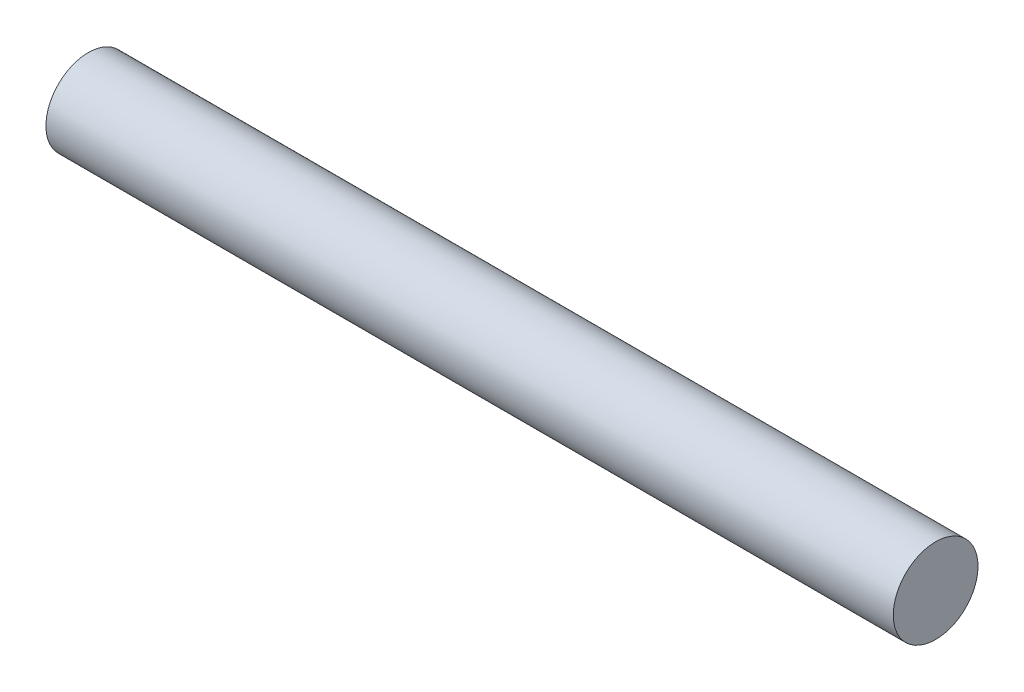
ISO-10303-21;
HEADER;
FILE_DESCRIPTION(('STEP AP214'),'2;1');
FILE_NAME('part.step','',(''),(''),'','','');
FILE_SCHEMA(('AUTOMOTIVE_DESIGN { 1 0 10303 214 1 1 1 1 }'));
ENDSEC;
DATA;
#1=APPLICATION_CONTEXT('core data for automotive mechanical design processes');
#2=APPLICATION_PROTOCOL_DEFINITION('international standard','automotive_design',2000,#1);
#3=PRODUCT_CONTEXT('',#1,'mechanical');
#4=PRODUCT('Part','Part','',(#3));
#5=PRODUCT_RELATED_PRODUCT_CATEGORY('part','',(#4));
#6=PRODUCT_DEFINITION_FORMATION('','',#4);
#7=PRODUCT_DEFINITION_CONTEXT('part definition',#1,'design');
#8=PRODUCT_DEFINITION('design','',#6,#7);
#9=PRODUCT_DEFINITION_SHAPE('','',#8);
#10=(LENGTH_UNIT() NAMED_UNIT(*) SI_UNIT(.MILLI.,.METRE.));
#11=(NAMED_UNIT(*) PLANE_ANGLE_UNIT() SI_UNIT($,.RADIAN.));
#12=(NAMED_UNIT(*) SI_UNIT($,.STERADIAN.) SOLID_ANGLE_UNIT());
#13=UNCERTAINTY_MEASURE_WITH_UNIT(LENGTH_MEASURE(1.E-05),#10,'distance_accuracy_value','');
#14=(GEOMETRIC_REPRESENTATION_CONTEXT(3) GLOBAL_UNCERTAINTY_ASSIGNED_CONTEXT((#13)) GLOBAL_UNIT_ASSIGNED_CONTEXT((#10,
#11,#12)) REPRESENTATION_CONTEXT('',''));
#15=CARTESIAN_POINT('',(0.,0.,0.));
#16=DIRECTION('',(0.,0.,1.));
#17=DIRECTION('',(1.,0.,0.));
#18=AXIS2_PLACEMENT_3D('',#15,#16,#17);
#19=CARTESIAN_POINT('',(190.5,0.,0.));
#20=DIRECTION('',(-1.,0.,0.));
#21=DIRECTION('',(0.,0.,1.));
#22=AXIS2_PLACEMENT_3D('',#19,#20,#21);
#23=CYLINDRICAL_SURFACE('',#22,9.525);
#24=CARTESIAN_POINT('',(190.5,0.,0.));
#25=DIRECTION('',(1.,0.,0.));
#26=DIRECTION('',(0.,0.,-1.));
#27=AXIS2_PLACEMENT_3D('',#24,#25,#26);
#28=CIRCLE('',#27,9.525);
#29=CARTESIAN_POINT('',(190.5,0.,-9.525));
#30=VERTEX_POINT('',#29);
#31=EDGE_CURVE('E10',#30,#30,#28,.T.);
#32=ORIENTED_EDGE('',*,*,#31,.F.);
#33=EDGE_LOOP('',(#32));
#34=FACE_BOUND('',#33,.T.);
#35=CARTESIAN_POINT('',(0.,0.,0.));
#36=DIRECTION('',(1.,0.,0.));
#37=DIRECTION('',(0.,0.,-1.));
#38=AXIS2_PLACEMENT_3D('',#35,#36,#37);
#39=CIRCLE('',#38,9.525);
#40=CARTESIAN_POINT('',(0.,0.,-9.525));
#41=VERTEX_POINT('',#40);
#42=EDGE_CURVE('E34',#41,#41,#39,.T.);
#43=ORIENTED_EDGE('',*,*,#42,.T.);
#44=EDGE_LOOP('',(#43));
#45=FACE_BOUND('',#44,.T.);
#46=ADVANCED_FACE('F31',(#34,#45),#23,.T.);
#47=CARTESIAN_POINT('',(190.5,0.,0.));
#48=DIRECTION('',(1.,0.,0.));
#49=DIRECTION('',(0.,0.,-1.));
#50=AXIS2_PLACEMENT_3D('',#47,#48,#49);
#51=PLANE('',#50);
#52=ORIENTED_EDGE('',*,*,#31,.T.);
#53=EDGE_LOOP('',(#52));
#54=FACE_BOUND('',#53,.T.);
#55=ADVANCED_FACE('F46',(#54),#51,.T.);
#56=CARTESIAN_POINT('',(0.,0.,0.));
#57=DIRECTION('',(1.,0.,0.));
#58=DIRECTION('',(0.,0.,-1.));
#59=AXIS2_PLACEMENT_3D('',#56,#57,#58);
#60=PLANE('',#59);
#61=ORIENTED_EDGE('',*,*,#42,.F.);
#62=EDGE_LOOP('',(#61));
#63=FACE_BOUND('',#62,.T.);
#64=ADVANCED_FACE('F44',(#63),#60,.F.);
#65=CLOSED_SHELL('',(#46,#55,#64));
#66=MANIFOLD_SOLID_BREP('B2',#65);
#67=ADVANCED_BREP_SHAPE_REPRESENTATION('',(#18,#66),#14);
#68=SHAPE_DEFINITION_REPRESENTATION(#9,#67);
ENDSEC;
END-ISO-10303-21;
